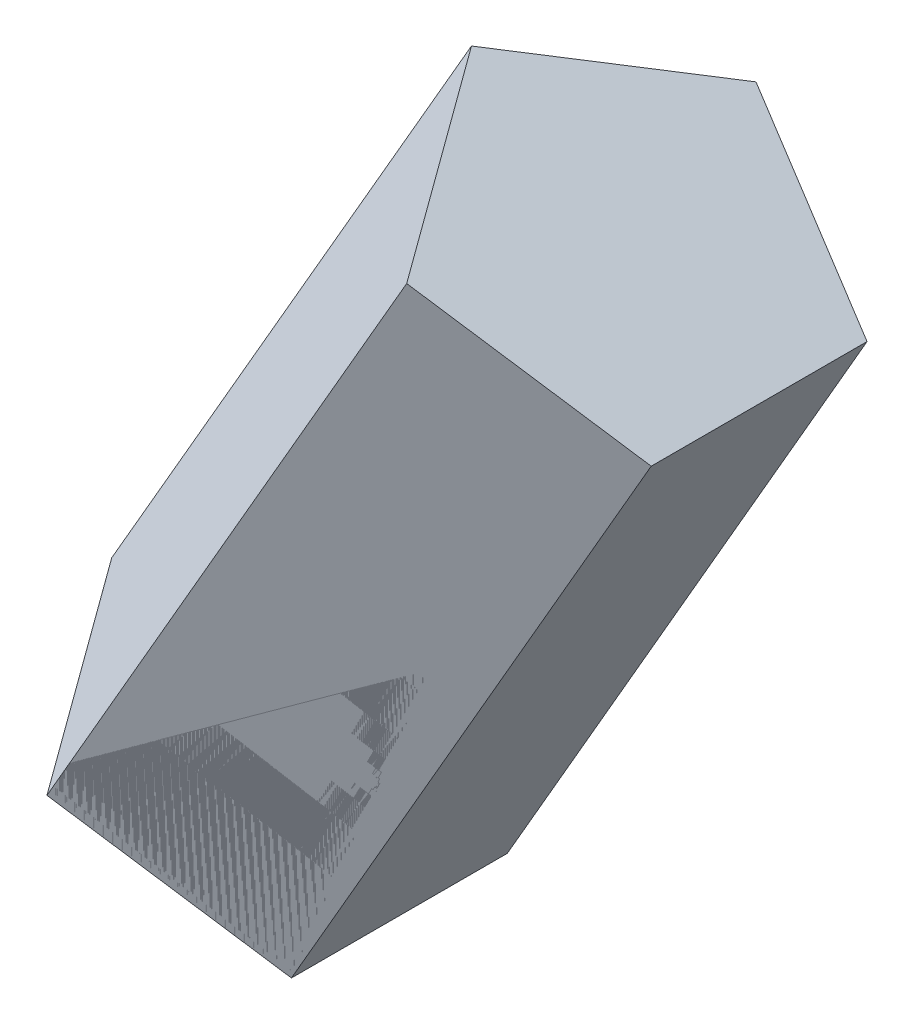
ISO-10303-21;
HEADER;
FILE_DESCRIPTION(('STEP AP214'),'2;1');
FILE_NAME('part.step','',(''),(''),'','','');
FILE_SCHEMA(('AUTOMOTIVE_DESIGN { 1 0 10303 214 1 1 1 1 }'));
ENDSEC;
DATA;
#1=APPLICATION_CONTEXT('core data for automotive mechanical design processes');
#2=APPLICATION_PROTOCOL_DEFINITION('international standard','automotive_design',2000,#1);
#3=PRODUCT_CONTEXT('',#1,'mechanical');
#4=PRODUCT('Part','Part','',(#3));
#5=PRODUCT_RELATED_PRODUCT_CATEGORY('part','',(#4));
#6=PRODUCT_DEFINITION_FORMATION('','',#4);
#7=PRODUCT_DEFINITION_CONTEXT('part definition',#1,'design');
#8=PRODUCT_DEFINITION('design','',#6,#7);
#9=PRODUCT_DEFINITION_SHAPE('','',#8);
#10=(LENGTH_UNIT() NAMED_UNIT(*) SI_UNIT(.MILLI.,.METRE.));
#11=(NAMED_UNIT(*) PLANE_ANGLE_UNIT() SI_UNIT($,.RADIAN.));
#12=(NAMED_UNIT(*) SI_UNIT($,.STERADIAN.) SOLID_ANGLE_UNIT());
#13=UNCERTAINTY_MEASURE_WITH_UNIT(LENGTH_MEASURE(1.E-05),#10,'distance_accuracy_value','');
#14=(GEOMETRIC_REPRESENTATION_CONTEXT(3) GLOBAL_UNCERTAINTY_ASSIGNED_CONTEXT((#13)) GLOBAL_UNIT_ASSIGNED_CONTEXT((#10,
#11,#12)) REPRESENTATION_CONTEXT('',''));
#15=CARTESIAN_POINT('',(0.,0.,0.));
#16=DIRECTION('',(0.,0.,1.));
#17=DIRECTION('',(1.,0.,0.));
#18=AXIS2_PLACEMENT_3D('',#15,#16,#17);
#19=CARTESIAN_POINT('',(155.29082689361,100.868388122871,74.2705098312483));
#20=DIRECTION('',(-0.700629269222039,0.40450849718747,0.587785252292473));
#21=DIRECTION('',(0.642715413742524,0.,0.766105016912026));
#22=AXIS2_PLACEMENT_3D('',#19,#20,#21);
#23=PLANE('',#22);
#24=DIRECTION('',(-0.50903696045513,0.293892626146233,-0.809016994374947));
#25=VECTOR('',#24,1.);
#26=CARTESIAN_POINT('',(105.29082689361,14.2658477444272,74.2705098312484));
#27=LINE('',#26,#25);
#28=CARTESIAN_POINT('',(105.29082689361,14.2658477444272,74.2705098312484));
#29=VERTEX_POINT('',#28);
#30=CARTESIAN_POINT('',(90.0197180799561,23.0826265288142,49.9999999999999));
#31=VERTEX_POINT('',#30);
#32=EDGE_CURVE('E124',#29,#31,#27,.T.);
#33=ORIENTED_EDGE('',*,*,#32,.F.);
#34=DIRECTION('',(-0.499999999999995,-0.866025403784442,0.));
#35=VECTOR('',#34,1.);
#36=CARTESIAN_POINT('',(155.29082689361,100.868388122871,74.2705098312483));
#37=LINE('',#36,#35);
#38=CARTESIAN_POINT('',(155.29082689361,100.868388122871,74.2705098312483));
#39=VERTEX_POINT('',#38);
#40=EDGE_CURVE('E13',#39,#29,#37,.T.);
#41=ORIENTED_EDGE('',*,*,#40,.F.);
#42=DIRECTION('',(-0.50903696045513,0.293892626146233,-0.809016994374947));
#43=VECTOR('',#42,1.);
#44=CARTESIAN_POINT('',(155.29082689361,100.868388122871,74.2705098312483));
#45=LINE('',#44,#43);
#46=CARTESIAN_POINT('',(140.019718079956,109.685166907258,49.9999999999999));
#47=VERTEX_POINT('',#46);
#48=EDGE_CURVE('E119',#39,#47,#45,.T.);
#49=ORIENTED_EDGE('',*,*,#48,.T.);
#50=DIRECTION('',(-0.499999999999995,-0.866025403784442,0.));
#51=VECTOR('',#50,1.);
#52=CARTESIAN_POINT('',(140.019718079956,109.685166907258,49.9999999999999));
#53=LINE('',#52,#51);
#54=EDGE_CURVE('E50',#47,#31,#53,.T.);
#55=ORIENTED_EDGE('',*,*,#54,.T.);
#56=EDGE_LOOP('',(#33,#41,#49,#55));
#57=FACE_BOUND('',#56,.T.);
#58=ADVANCED_FACE('F47',(#57),#23,.T.);
#59=CARTESIAN_POINT('',(180.,86.6025403784441,64.9999999999999));
#60=DIRECTION('',(0.267616567329819,-0.154508497187472,0.951056516295153));
#61=DIRECTION('',(0.962616130967096,0.,-0.270869312403489));
#62=AXIS2_PLACEMENT_3D('',#59,#60,#61);
#63=PLANE('',#62);
#64=DIRECTION('',(-0.823639103546334,0.475528258147572,0.309016994374948));
#65=VECTOR('',#64,1.);
#66=CARTESIAN_POINT('',(130.,0.,64.9999999999999));
#67=LINE('',#66,#65);
#68=CARTESIAN_POINT('',(130.,0.,64.9999999999999));
#69=VERTEX_POINT('',#68);
#70=EDGE_CURVE('E133',#69,#29,#67,.T.);
#71=ORIENTED_EDGE('',*,*,#70,.F.);
#72=DIRECTION('',(-0.499999999999995,-0.866025403784442,0.));
#73=VECTOR('',#72,1.);
#74=CARTESIAN_POINT('',(180.,86.6025403784441,64.9999999999999));
#75=LINE('',#74,#73);
#76=CARTESIAN_POINT('',(180.,86.6025403784441,64.9999999999999));
#77=VERTEX_POINT('',#76);
#78=EDGE_CURVE('E56',#77,#69,#75,.T.);
#79=ORIENTED_EDGE('',*,*,#78,.F.);
#80=DIRECTION('',(-0.823639103546334,0.475528258147572,0.309016994374948));
#81=VECTOR('',#80,1.);
#82=CARTESIAN_POINT('',(180.,86.6025403784441,64.9999999999999));
#83=LINE('',#82,#81);
#84=EDGE_CURVE('E114',#77,#39,#83,.T.);
#85=ORIENTED_EDGE('',*,*,#84,.T.);
#86=ORIENTED_EDGE('',*,*,#40,.T.);
#87=EDGE_LOOP('',(#71,#79,#85,#86));
#88=FACE_BOUND('',#87,.T.);
#89=ADVANCED_FACE('F139',(#88),#63,.T.);
#90=CARTESIAN_POINT('',(180.,86.6025403784441,34.9999999999999));
#91=DIRECTION('',(0.866025403784442,-0.499999999999995,0.));
#92=DIRECTION('',(0.499999999999995,0.866025403784442,0.));
#93=AXIS2_PLACEMENT_3D('',#90,#91,#92);
#94=PLANE('',#93);
#95=DIRECTION('',(0.,0.,1.));
#96=VECTOR('',#95,1.);
#97=CARTESIAN_POINT('',(130.,0.,34.9999999999999));
#98=LINE('',#97,#96);
#99=CARTESIAN_POINT('',(130.,0.,34.9999999999999));
#100=VERTEX_POINT('',#99);
#101=EDGE_CURVE('E103',#100,#69,#98,.T.);
#102=ORIENTED_EDGE('',*,*,#101,.F.);
#103=DIRECTION('',(-0.499999999999995,-0.866025403784442,0.));
#104=VECTOR('',#103,1.);
#105=CARTESIAN_POINT('',(180.,86.6025403784441,34.9999999999999));
#106=LINE('',#105,#104);
#107=CARTESIAN_POINT('',(180.,86.6025403784441,34.9999999999999));
#108=VERTEX_POINT('',#107);
#109=EDGE_CURVE('E98',#108,#100,#106,.T.);
#110=ORIENTED_EDGE('',*,*,#109,.F.);
#111=DIRECTION('',(0.,0.,1.));
#112=VECTOR('',#111,1.);
#113=CARTESIAN_POINT('',(180.,86.6025403784441,34.9999999999999));
#114=LINE('',#113,#112);
#115=EDGE_CURVE('E101',#108,#77,#114,.T.);
#116=ORIENTED_EDGE('',*,*,#115,.T.);
#117=ORIENTED_EDGE('',*,*,#78,.T.);
#118=EDGE_LOOP('',(#102,#110,#116,#117));
#119=FACE_BOUND('',#118,.T.);
#120=ADVANCED_FACE('F100',(#119),#94,.T.);
#121=CARTESIAN_POINT('',(155.29082689361,100.868388122871,25.7294901687515));
#122=DIRECTION('',(0.267616567329817,-0.154508497187472,-0.951056516295154));
#123=DIRECTION('',(-0.962616130967096,0.,-0.270869312403487));
#124=AXIS2_PLACEMENT_3D('',#121,#122,#123);
#125=PLANE('',#124);
#126=DIRECTION('',(0.823639103546335,-0.475528258147572,0.309016994374947));
#127=VECTOR('',#126,1.);
#128=CARTESIAN_POINT('',(105.29082689361,14.2658477444272,25.7294901687515));
#129=LINE('',#128,#127);
#130=CARTESIAN_POINT('',(105.29082689361,14.2658477444272,25.7294901687515));
#131=VERTEX_POINT('',#130);
#132=EDGE_CURVE('E130',#131,#100,#129,.T.);
#133=ORIENTED_EDGE('',*,*,#132,.F.);
#134=DIRECTION('',(-0.499999999999995,-0.866025403784442,0.));
#135=VECTOR('',#134,1.);
#136=CARTESIAN_POINT('',(155.29082689361,100.868388122871,25.7294901687515));
#137=LINE('',#136,#135);
#138=CARTESIAN_POINT('',(155.29082689361,100.868388122871,25.7294901687515));
#139=VERTEX_POINT('',#138);
#140=EDGE_CURVE('E108',#139,#131,#137,.T.);
#141=ORIENTED_EDGE('',*,*,#140,.F.);
#142=DIRECTION('',(0.823639103546335,-0.475528258147572,0.309016994374947));
#143=VECTOR('',#142,1.);
#144=CARTESIAN_POINT('',(155.29082689361,100.868388122871,25.7294901687515));
#145=LINE('',#144,#143);
#146=EDGE_CURVE('E113',#139,#108,#145,.T.);
#147=ORIENTED_EDGE('',*,*,#146,.T.);
#148=ORIENTED_EDGE('',*,*,#109,.T.);
#149=EDGE_LOOP('',(#133,#141,#147,#148));
#150=FACE_BOUND('',#149,.T.);
#151=ADVANCED_FACE('F116',(#150),#125,.T.);
#152=CARTESIAN_POINT('',(140.019718079956,109.685166907258,49.9999999999999));
#153=DIRECTION('',(-0.700629269222039,0.404508497187469,-0.587785252292473));
#154=DIRECTION('',(-0.642715413742524,0.,0.766105016912026));
#155=AXIS2_PLACEMENT_3D('',#152,#153,#154);
#156=PLANE('',#155);
#157=DIRECTION('',(0.509036960455129,-0.293892626146233,-0.809016994374947));
#158=VECTOR('',#157,1.);
#159=CARTESIAN_POINT('',(90.0197180799561,23.0826265288142,49.9999999999999));
#160=LINE('',#159,#158);
#161=EDGE_CURVE('E127',#31,#131,#160,.T.);
#162=ORIENTED_EDGE('',*,*,#161,.F.);
#163=ORIENTED_EDGE('',*,*,#54,.F.);
#164=DIRECTION('',(0.509036960455129,-0.293892626146233,-0.809016994374947));
#165=VECTOR('',#164,1.);
#166=CARTESIAN_POINT('',(140.019718079956,109.685166907258,49.9999999999999));
#167=LINE('',#166,#165);
#168=EDGE_CURVE('E117',#47,#139,#167,.T.);
#169=ORIENTED_EDGE('',*,*,#168,.T.);
#170=ORIENTED_EDGE('',*,*,#140,.T.);
#171=EDGE_LOOP('',(#162,#163,#169,#170));
#172=FACE_BOUND('',#171,.T.);
#173=ADVANCED_FACE('F136',(#172),#156,.T.);
#174=CARTESIAN_POINT('',(82.4999999999988,142.894191624432,0.));
#175=DIRECTION('',(-0.499999999999994,-0.866025403784442,0.));
#176=DIRECTION('',(0.866025403784442,-0.499999999999994,0.));
#177=AXIS2_PLACEMENT_3D('',#174,#175,#176);
#178=PLANE('',#177);
#179=ORIENTED_EDGE('',*,*,#48,.F.);
#180=ORIENTED_EDGE('',*,*,#84,.F.);
#181=ORIENTED_EDGE('',*,*,#115,.F.);
#182=ORIENTED_EDGE('',*,*,#146,.F.);
#183=ORIENTED_EDGE('',*,*,#168,.F.);
#184=EDGE_LOOP('',(#179,#180,#181,#182,#183));
#185=FACE_BOUND('',#184,.T.);
#186=ADVANCED_FACE('F112',(#185),#178,.F.);
#187=CARTESIAN_POINT('',(32.4999999999993,56.2916512459881,0.));
#188=DIRECTION('',(-0.499999999999994,-0.866025403784442,0.));
#189=DIRECTION('',(0.866025403784442,-0.499999999999994,0.));
#190=AXIS2_PLACEMENT_3D('',#187,#188,#189);
#191=PLANE('',#190);
#192=ORIENTED_EDGE('',*,*,#32,.T.);
#193=ORIENTED_EDGE('',*,*,#161,.T.);
#194=ORIENTED_EDGE('',*,*,#132,.T.);
#195=ORIENTED_EDGE('',*,*,#101,.T.);
#196=ORIENTED_EDGE('',*,*,#70,.T.);
#197=EDGE_LOOP('',(#192,#193,#194,#195,#196));
#198=FACE_BOUND('',#197,.T.);
#199=ADVANCED_FACE('F138',(#198),#191,.T.);
#200=CLOSED_SHELL('',(#58,#89,#120,#151,#173,#186,#199));
#201=MANIFOLD_SOLID_BREP('B2',#200);
#202=CARTESIAN_POINT('',(140.019718079956,109.685166907258,49.9999999999999));
#203=DIRECTION('',(-0.700629269222039,0.40450849718747,-0.587785252292473));
#204=DIRECTION('',(-0.642715413742524,0.,0.766105016912027));
#205=AXIS2_PLACEMENT_3D('',#202,#203,#204);
#206=PLANE('',#205);
#207=DIRECTION('',(-0.682998245278715,-0.618582688912142,0.388418400599689));
#208=VECTOR('',#207,1.);
#209=CARTESIAN_POINT('',(149.928923335785,77.3579142274024,15.9410855263688));
#210=LINE('',#209,#208);
#211=CARTESIAN_POINT('',(132.716908702844,61.7692148905614,25.7294901687515));
#212=VERTEX_POINT('',#211);
#213=CARTESIAN_POINT('',(90.0394361599126,23.1167792451265,49.9999999999999));
#214=VERTEX_POINT('',#213);
#215=EDGE_CURVE('E254',#212,#214,#210,.T.);
#216=ORIENTED_EDGE('',*,*,#215,.F.);
#217=DIRECTION('',(-0.499999999999995,-0.866025403784442,0.));
#218=VECTOR('',#217,1.);
#219=CARTESIAN_POINT('',(155.29082689361,100.868388122871,25.7294901687515));
#220=LINE('',#219,#218);
#221=CARTESIAN_POINT('',(105.29082689361,14.2658477444272,25.7294901687515));
#222=VERTEX_POINT('',#221);
#223=EDGE_CURVE('E242',#212,#222,#220,.T.);
#224=ORIENTED_EDGE('',*,*,#223,.T.);
#225=DIRECTION('',(0.509036960455129,-0.293892626146233,-0.809016994374947));
#226=VECTOR('',#225,1.);
#227=CARTESIAN_POINT('',(90.0197180799561,23.0826265288142,49.9999999999999));
#228=LINE('',#227,#226);
#229=CARTESIAN_POINT('',(90.0197180799561,23.0826265288142,49.9999999999999));
#230=VERTEX_POINT('',#229);
#231=EDGE_CURVE('E256',#230,#222,#228,.T.);
#232=ORIENTED_EDGE('',*,*,#231,.F.);
#233=DIRECTION('',(-0.499999999999995,-0.866025403784442,0.));
#234=VECTOR('',#233,1.);
#235=CARTESIAN_POINT('',(140.019718079956,109.685166907258,49.9999999999999));
#236=LINE('',#235,#234);
#237=EDGE_CURVE('E203',#214,#230,#236,.T.);
#238=ORIENTED_EDGE('',*,*,#237,.F.);
#239=EDGE_LOOP('',(#216,#224,#232,#238));
#240=FACE_BOUND('',#239,.T.);
#241=ADVANCED_FACE('F196',(#240),#206,.T.);
#242=CARTESIAN_POINT('',(155.29082689361,100.868388122871,74.2705098312483));
#243=DIRECTION('',(-0.700629269222039,0.40450849718747,0.587785252292473));
#244=DIRECTION('',(0.642715413742524,0.,0.766105016912026));
#245=AXIS2_PLACEMENT_3D('',#242,#243,#244);
#246=PLANE('',#245);
#247=DIRECTION('',(0.600581620915867,-0.110456098042504,0.791897194731295));
#248=VECTOR('',#247,1.);
#249=CARTESIAN_POINT('',(119.960649942329,17.6138127739558,89.4526313028326));
#250=LINE('',#249,#248);
#251=CARTESIAN_POINT('',(108.446398871596,19.7314587372396,74.2705098312484));
#252=VERTEX_POINT('',#251);
#253=EDGE_CURVE('E210',#214,#252,#250,.T.);
#254=ORIENTED_EDGE('',*,*,#253,.F.);
#255=ORIENTED_EDGE('',*,*,#237,.T.);
#256=DIRECTION('',(-0.50903696045513,0.293892626146233,-0.809016994374947));
#257=VECTOR('',#256,1.);
#258=CARTESIAN_POINT('',(105.29082689361,14.2658477444272,74.2705098312484));
#259=LINE('',#258,#257);
#260=CARTESIAN_POINT('',(105.29082689361,14.2658477444272,74.2705098312484));
#261=VERTEX_POINT('',#260);
#262=EDGE_CURVE('E252',#261,#230,#259,.T.);
#263=ORIENTED_EDGE('',*,*,#262,.F.);
#264=DIRECTION('',(-0.499999999999995,-0.866025403784442,0.));
#265=VECTOR('',#264,1.);
#266=CARTESIAN_POINT('',(155.29082689361,100.868388122871,74.2705098312483));
#267=LINE('',#266,#265);
#268=EDGE_CURVE('E277',#252,#261,#267,.T.);
#269=ORIENTED_EDGE('',*,*,#268,.F.);
#270=EDGE_LOOP('',(#254,#255,#263,#269));
#271=FACE_BOUND('',#270,.T.);
#272=ADVANCED_FACE('F287',(#271),#246,.T.);
#273=CARTESIAN_POINT('',(180.,86.6025403784442,64.9999999999999));
#274=DIRECTION('',(0.267616567329819,-0.154508497187472,0.951056516295153));
#275=DIRECTION('',(0.962616130967096,0.,-0.270869312403489));
#276=AXIS2_PLACEMENT_3D('',#273,#274,#275);
#277=PLANE('',#276);
#278=DIRECTION('',(0.820088342685987,0.554682519885349,-0.140649963825772));
#279=VECTOR('',#278,1.);
#280=CARTESIAN_POINT('',(188.057615568653,73.5780359779683,60.6167189336813));
#281=LINE('',#280,#279);
#282=CARTESIAN_POINT('',(162.5,56.2916512459884,64.9999999999999));
#283=VERTEX_POINT('',#282);
#284=EDGE_CURVE('E218',#252,#283,#281,.T.);
#285=ORIENTED_EDGE('',*,*,#284,.F.);
#286=ORIENTED_EDGE('',*,*,#268,.T.);
#287=DIRECTION('',(-0.823639103546334,0.475528258147572,0.309016994374948));
#288=VECTOR('',#287,1.);
#289=CARTESIAN_POINT('',(130.,0.,64.9999999999999));
#290=LINE('',#289,#288);
#291=CARTESIAN_POINT('',(130.,0.,64.9999999999999));
#292=VERTEX_POINT('',#291);
#293=EDGE_CURVE('E271',#292,#261,#290,.T.);
#294=ORIENTED_EDGE('',*,*,#293,.F.);
#295=DIRECTION('',(-0.499999999999995,-0.866025403784442,0.));
#296=VECTOR('',#295,1.);
#297=CARTESIAN_POINT('',(180.,86.6025403784442,64.9999999999999));
#298=LINE('',#297,#296);
#299=EDGE_CURVE('E279',#283,#292,#298,.T.);
#300=ORIENTED_EDGE('',*,*,#299,.F.);
#301=EDGE_LOOP('',(#285,#286,#294,#300));
#302=FACE_BOUND('',#301,.T.);
#303=ADVANCED_FACE('F288',(#302),#277,.T.);
#304=CARTESIAN_POINT('',(180.,86.6025403784442,34.9999999999999));
#305=DIRECTION('',(0.866025403784442,-0.499999999999995,0.));
#306=DIRECTION('',(0.499999999999995,0.866025403784442,0.));
#307=AXIS2_PLACEMENT_3D('',#304,#305,#306);
#308=PLANE('',#307);
#309=DIRECTION('',(0.353553390593268,0.612372435695793,-0.707106781186552));
#310=VECTOR('',#309,1.);
#311=CARTESIAN_POINT('',(178.749999999999,84.4374768689827,32.4999999999995));
#312=LINE('',#311,#310);
#313=CARTESIAN_POINT('',(177.499999999999,82.2724133595214,34.9999999999999));
#314=VERTEX_POINT('',#313);
#315=EDGE_CURVE('E260',#283,#314,#312,.T.);
#316=ORIENTED_EDGE('',*,*,#315,.F.);
#317=ORIENTED_EDGE('',*,*,#299,.T.);
#318=DIRECTION('',(0.,0.,1.));
#319=VECTOR('',#318,1.);
#320=CARTESIAN_POINT('',(130.,0.,34.9999999999999));
#321=LINE('',#320,#319);
#322=CARTESIAN_POINT('',(130.,0.,34.9999999999999));
#323=VERTEX_POINT('',#322);
#324=EDGE_CURVE('E268',#323,#292,#321,.T.);
#325=ORIENTED_EDGE('',*,*,#324,.F.);
#326=DIRECTION('',(-0.499999999999995,-0.866025403784442,0.));
#327=VECTOR('',#326,1.);
#328=CARTESIAN_POINT('',(180.,86.6025403784442,34.9999999999999));
#329=LINE('',#328,#327);
#330=EDGE_CURVE('E251',#314,#323,#329,.T.);
#331=ORIENTED_EDGE('',*,*,#330,.F.);
#332=EDGE_LOOP('',(#316,#317,#325,#331));
#333=FACE_BOUND('',#332,.T.);
#334=ADVANCED_FACE('F282',(#333),#308,.T.);
#335=CARTESIAN_POINT('',(155.29082689361,100.868388122871,25.7294901687515));
#336=DIRECTION('',(0.267616567329818,-0.154508497187472,-0.951056516295154));
#337=DIRECTION('',(-0.962616130967096,0.,-0.270869312403487));
#338=AXIS2_PLACEMENT_3D('',#335,#336,#337);
#339=PLANE('',#338);
#340=DIRECTION('',(-0.893546843461344,-0.409095659592493,-0.184972375891245));
#341=VECTOR('',#340,1.);
#342=CARTESIAN_POINT('',(165.033062706817,76.5646320916743,32.4192298612189));
#343=LINE('',#342,#341);
#344=EDGE_CURVE('E45',#314,#212,#343,.T.);
#345=ORIENTED_EDGE('',*,*,#344,.F.);
#346=ORIENTED_EDGE('',*,*,#330,.T.);
#347=DIRECTION('',(0.823639103546335,-0.475528258147572,0.309016994374947));
#348=VECTOR('',#347,1.);
#349=CARTESIAN_POINT('',(105.29082689361,14.2658477444272,25.7294901687515));
#350=LINE('',#349,#348);
#351=EDGE_CURVE('E247',#222,#323,#350,.T.);
#352=ORIENTED_EDGE('',*,*,#351,.F.);
#353=ORIENTED_EDGE('',*,*,#223,.F.);
#354=EDGE_LOOP('',(#345,#346,#352,#353));
#355=FACE_BOUND('',#354,.T.);
#356=ADVANCED_FACE('F244',(#355),#339,.T.);
#357=CARTESIAN_POINT('',(32.4999999999993,56.2916512459881,0.));
#358=DIRECTION('',(-0.499999999999995,-0.866025403784442,0.));
#359=DIRECTION('',(0.866025403784442,-0.499999999999995,0.));
#360=AXIS2_PLACEMENT_3D('',#357,#358,#359);
#361=PLANE('',#360);
#362=ORIENTED_EDGE('',*,*,#231,.T.);
#363=ORIENTED_EDGE('',*,*,#351,.T.);
#364=ORIENTED_EDGE('',*,*,#324,.T.);
#365=ORIENTED_EDGE('',*,*,#293,.T.);
#366=ORIENTED_EDGE('',*,*,#262,.T.);
#367=EDGE_LOOP('',(#362,#363,#364,#365,#366));
#368=FACE_BOUND('',#367,.T.);
#369=ADVANCED_FACE('F285',(#368),#361,.T.);
#370=CARTESIAN_POINT('',(0.,0.,0.));
#371=DIRECTION('',(0.447213595499958,-0.774596669241484,-0.447213595499957));
#372=DIRECTION('',(0.866025403784439,0.5,0.));
#373=AXIS2_PLACEMENT_3D('',#370,#371,#372);
#374=PLANE('',#373);
#375=ORIENTED_EDGE('',*,*,#344,.T.);
#376=ORIENTED_EDGE('',*,*,#215,.T.);
#377=ORIENTED_EDGE('',*,*,#253,.T.);
#378=ORIENTED_EDGE('',*,*,#284,.T.);
#379=ORIENTED_EDGE('',*,*,#315,.T.);
#380=EDGE_LOOP('',(#375,#376,#377,#378,#379));
#381=FACE_BOUND('',#380,.T.);
#382=ADVANCED_FACE('F259',(#381),#374,.F.);
#383=CLOSED_SHELL('',(#241,#272,#303,#334,#356,#369,#382));
#384=MANIFOLD_SOLID_BREP('B7',#383);
#385=ADVANCED_BREP_SHAPE_REPRESENTATION('',(#18,#201,#384),#14);
#386=SHAPE_DEFINITION_REPRESENTATION(#9,#385);
ENDSEC;
END-ISO-10303-21;
